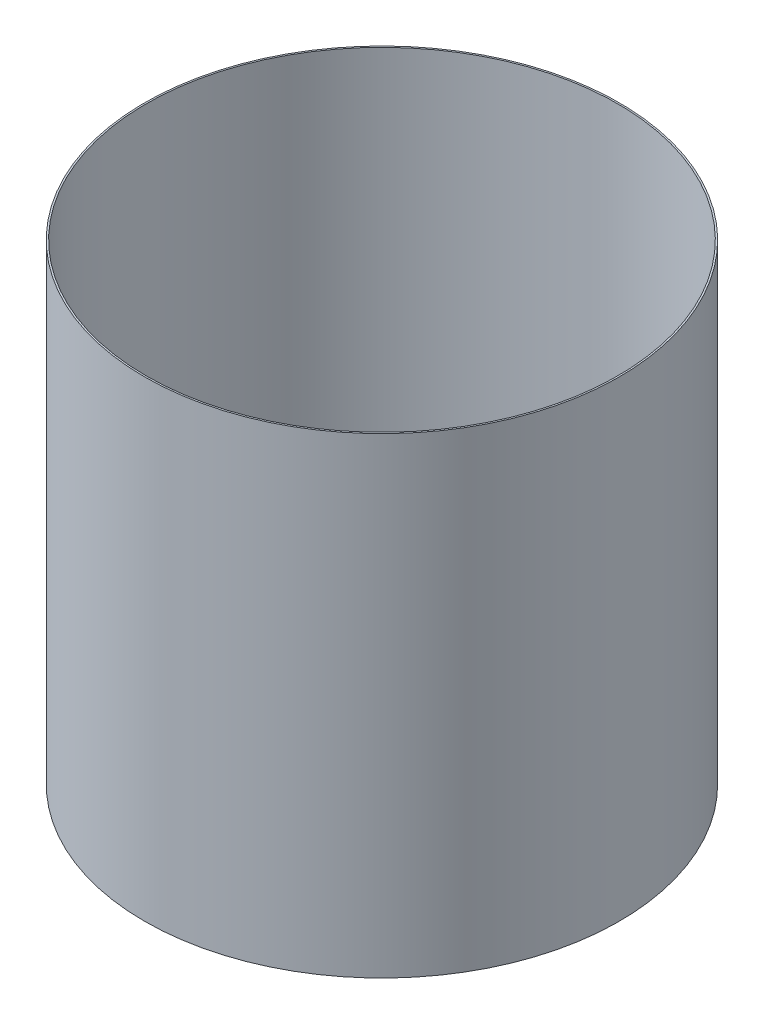
ISO-10303-21;
HEADER;
FILE_DESCRIPTION(('STEP AP214'),'2;1');
FILE_NAME('part.step','',(''),(''),'','','');
FILE_SCHEMA(('AUTOMOTIVE_DESIGN { 1 0 10303 214 1 1 1 1 }'));
ENDSEC;
DATA;
#1=APPLICATION_CONTEXT('core data for automotive mechanical design processes');
#2=APPLICATION_PROTOCOL_DEFINITION('international standard','automotive_design',2000,#1);
#3=PRODUCT_CONTEXT('',#1,'mechanical');
#4=PRODUCT('Part','Part','',(#3));
#5=PRODUCT_RELATED_PRODUCT_CATEGORY('part','',(#4));
#6=PRODUCT_DEFINITION_FORMATION('','',#4);
#7=PRODUCT_DEFINITION_CONTEXT('part definition',#1,'design');
#8=PRODUCT_DEFINITION('design','',#6,#7);
#9=PRODUCT_DEFINITION_SHAPE('','',#8);
#10=(LENGTH_UNIT() NAMED_UNIT(*) SI_UNIT(.MILLI.,.METRE.));
#11=(NAMED_UNIT(*) PLANE_ANGLE_UNIT() SI_UNIT($,.RADIAN.));
#12=(NAMED_UNIT(*) SI_UNIT($,.STERADIAN.) SOLID_ANGLE_UNIT());
#13=UNCERTAINTY_MEASURE_WITH_UNIT(LENGTH_MEASURE(1.E-05),#10,'distance_accuracy_value','');
#14=(GEOMETRIC_REPRESENTATION_CONTEXT(3) GLOBAL_UNCERTAINTY_ASSIGNED_CONTEXT((#13)) GLOBAL_UNIT_ASSIGNED_CONTEXT((#10,
#11,#12)) REPRESENTATION_CONTEXT('',''));
#15=CARTESIAN_POINT('',(0.,0.,0.));
#16=DIRECTION('',(0.,0.,1.));
#17=DIRECTION('',(1.,0.,0.));
#18=AXIS2_PLACEMENT_3D('',#15,#16,#17);
#19=CARTESIAN_POINT('',(0.,228.6,0.));
#20=DIRECTION('',(0.,1.,0.));
#21=DIRECTION('',(0.,0.,1.));
#22=AXIS2_PLACEMENT_3D('',#19,#20,#21);
#23=PLANE('',#22);
#24=CARTESIAN_POINT('',(0.,228.6,0.));
#25=DIRECTION('',(0.,1.,0.));
#26=DIRECTION('',(0.,0.,1.));
#27=AXIS2_PLACEMENT_3D('',#24,#25,#26);
#28=CIRCLE('',#27,230.1875);
#29=CARTESIAN_POINT('',(0.,228.6,230.1875));
#30=VERTEX_POINT('',#29);
#31=EDGE_CURVE('E10',#30,#30,#28,.T.);
#32=ORIENTED_EDGE('',*,*,#31,.T.);
#33=EDGE_LOOP('',(#32));
#34=FACE_BOUND('',#33,.T.);
#35=CARTESIAN_POINT('',(0.,228.6,0.));
#36=DIRECTION('',(0.,1.,0.));
#37=DIRECTION('',(0.,0.,1.));
#38=AXIS2_PLACEMENT_3D('',#35,#36,#37);
#39=CIRCLE('',#38,228.6);
#40=CARTESIAN_POINT('',(0.,228.6,228.6));
#41=VERTEX_POINT('',#40);
#42=EDGE_CURVE('E44',#41,#41,#39,.T.);
#43=ORIENTED_EDGE('',*,*,#42,.F.);
#44=EDGE_LOOP('',(#43));
#45=FACE_BOUND('',#44,.T.);
#46=ADVANCED_FACE('F33',(#34,#45),#23,.T.);
#47=CARTESIAN_POINT('',(0.,-228.6,0.));
#48=DIRECTION('',(0.,1.,0.));
#49=DIRECTION('',(0.,0.,1.));
#50=AXIS2_PLACEMENT_3D('',#47,#48,#49);
#51=PLANE('',#50);
#52=CARTESIAN_POINT('',(0.,-228.6,0.));
#53=DIRECTION('',(0.,1.,0.));
#54=DIRECTION('',(0.,0.,1.));
#55=AXIS2_PLACEMENT_3D('',#52,#53,#54);
#56=CIRCLE('',#55,230.1875);
#57=CARTESIAN_POINT('',(0.,-228.6,230.1875));
#58=VERTEX_POINT('',#57);
#59=EDGE_CURVE('E37',#58,#58,#56,.T.);
#60=ORIENTED_EDGE('',*,*,#59,.F.);
#61=EDGE_LOOP('',(#60));
#62=FACE_BOUND('',#61,.T.);
#63=CARTESIAN_POINT('',(0.,-228.6,0.));
#64=DIRECTION('',(0.,1.,0.));
#65=DIRECTION('',(0.,0.,1.));
#66=AXIS2_PLACEMENT_3D('',#63,#64,#65);
#67=CIRCLE('',#66,228.6);
#68=CARTESIAN_POINT('',(0.,-228.6,228.6));
#69=VERTEX_POINT('',#68);
#70=EDGE_CURVE('E46',#69,#69,#67,.T.);
#71=ORIENTED_EDGE('',*,*,#70,.T.);
#72=EDGE_LOOP('',(#71));
#73=FACE_BOUND('',#72,.T.);
#74=ADVANCED_FACE('F56',(#62,#73),#51,.F.);
#75=CARTESIAN_POINT('',(0.,228.6,0.));
#76=DIRECTION('',(0.,-1.,0.));
#77=DIRECTION('',(0.,0.,-1.));
#78=AXIS2_PLACEMENT_3D('',#75,#76,#77);
#79=CYLINDRICAL_SURFACE('',#78,230.1875);
#80=ORIENTED_EDGE('',*,*,#31,.F.);
#81=EDGE_LOOP('',(#80));
#82=FACE_BOUND('',#81,.T.);
#83=ORIENTED_EDGE('',*,*,#59,.T.);
#84=EDGE_LOOP('',(#83));
#85=FACE_BOUND('',#84,.T.);
#86=ADVANCED_FACE('F35',(#82,#85),#79,.T.);
#87=CARTESIAN_POINT('',(0.,228.6,0.));
#88=DIRECTION('',(0.,-1.,0.));
#89=DIRECTION('',(0.,0.,-1.));
#90=AXIS2_PLACEMENT_3D('',#87,#88,#89);
#91=CYLINDRICAL_SURFACE('',#90,228.6);
#92=ORIENTED_EDGE('',*,*,#42,.T.);
#93=EDGE_LOOP('',(#92));
#94=FACE_BOUND('',#93,.T.);
#95=ORIENTED_EDGE('',*,*,#70,.F.);
#96=EDGE_LOOP('',(#95));
#97=FACE_BOUND('',#96,.T.);
#98=ADVANCED_FACE('F52',(#94,#97),#91,.F.);
#99=CLOSED_SHELL('',(#46,#74,#86,#98));
#100=MANIFOLD_SOLID_BREP('B2',#99);
#101=ADVANCED_BREP_SHAPE_REPRESENTATION('',(#18,#100),#14);
#102=SHAPE_DEFINITION_REPRESENTATION(#9,#101);
ENDSEC;
END-ISO-10303-21;
